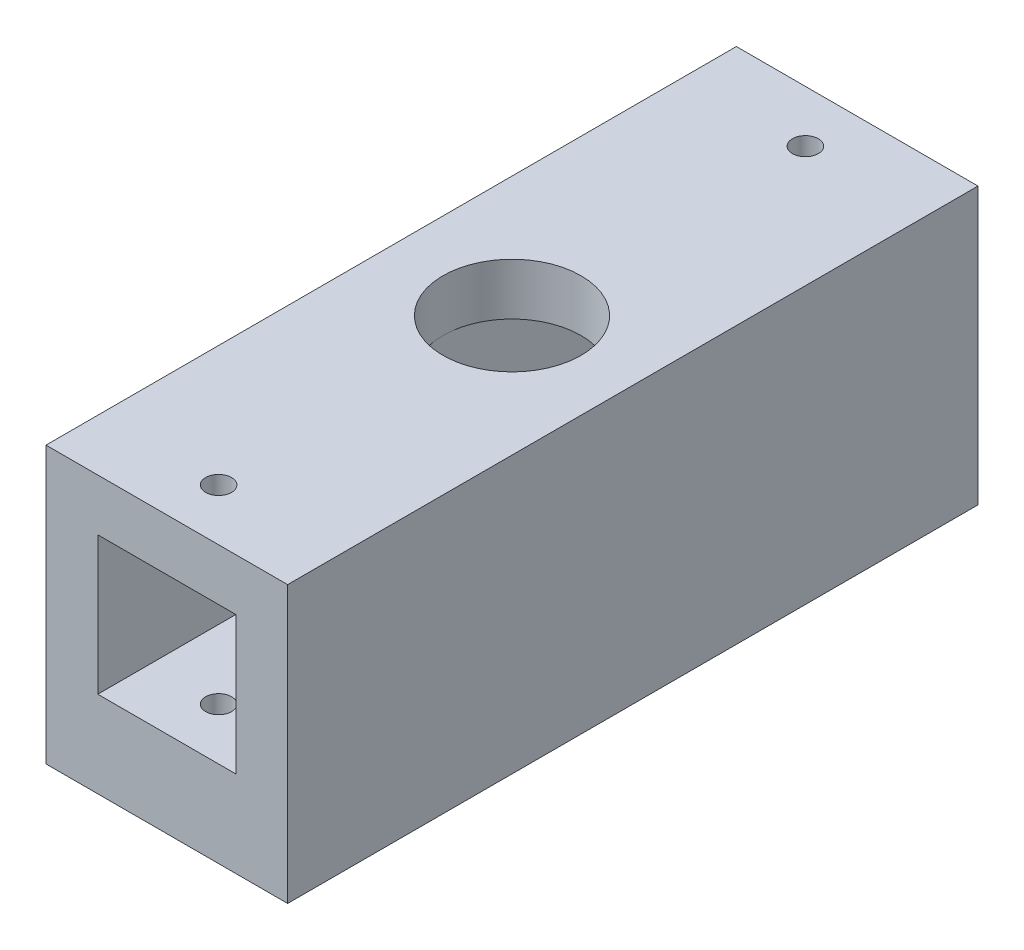
ISO-10303-21;
HEADER;
FILE_DESCRIPTION(('STEP AP214'),'2;1');
FILE_NAME('part.step','',(''),(''),'','','');
FILE_SCHEMA(('AUTOMOTIVE_DESIGN { 1 0 10303 214 1 1 1 1 }'));
ENDSEC;
DATA;
#1=APPLICATION_CONTEXT('core data for automotive mechanical design processes');
#2=APPLICATION_PROTOCOL_DEFINITION('international standard','automotive_design',2000,#1);
#3=PRODUCT_CONTEXT('',#1,'mechanical');
#4=PRODUCT('Part','Part','',(#3));
#5=PRODUCT_RELATED_PRODUCT_CATEGORY('part','',(#4));
#6=PRODUCT_DEFINITION_FORMATION('','',#4);
#7=PRODUCT_DEFINITION_CONTEXT('part definition',#1,'design');
#8=PRODUCT_DEFINITION('design','',#6,#7);
#9=PRODUCT_DEFINITION_SHAPE('','',#8);
#10=(LENGTH_UNIT() NAMED_UNIT(*) SI_UNIT(.MILLI.,.METRE.));
#11=(NAMED_UNIT(*) PLANE_ANGLE_UNIT() SI_UNIT($,.RADIAN.));
#12=(NAMED_UNIT(*) SI_UNIT($,.STERADIAN.) SOLID_ANGLE_UNIT());
#13=UNCERTAINTY_MEASURE_WITH_UNIT(LENGTH_MEASURE(1.E-05),#10,'distance_accuracy_value','');
#14=(GEOMETRIC_REPRESENTATION_CONTEXT(3) GLOBAL_UNCERTAINTY_ASSIGNED_CONTEXT((#13)) GLOBAL_UNIT_ASSIGNED_CONTEXT((#10,
#11,#12)) REPRESENTATION_CONTEXT('',''));
#15=CARTESIAN_POINT('',(0.,0.,0.));
#16=DIRECTION('',(0.,0.,1.));
#17=DIRECTION('',(1.,0.,0.));
#18=AXIS2_PLACEMENT_3D('',#15,#16,#17);
#19=CARTESIAN_POINT('',(-4.,4.,40.));
#20=DIRECTION('',(0.,-1.,0.));
#21=DIRECTION('',(0.,0.,-1.));
#22=AXIS2_PLACEMENT_3D('',#19,#20,#21);
#23=PLANE('',#22);
#24=CARTESIAN_POINT('',(0.,4.,37.));
#25=DIRECTION('',(0.,-1.,0.));
#26=DIRECTION('',(0.,0.,-1.));
#27=AXIS2_PLACEMENT_3D('',#24,#25,#26);
#28=CIRCLE('',#27,0.75);
#29=CARTESIAN_POINT('',(0.,4.,36.25));
#30=VERTEX_POINT('',#29);
#31=EDGE_CURVE('E182',#30,#30,#28,.T.);
#32=ORIENTED_EDGE('',*,*,#31,.F.);
#33=EDGE_LOOP('',(#32));
#34=FACE_BOUND('',#33,.T.);
#35=DIRECTION('',(0.,0.,-1.));
#36=VECTOR('',#35,1.);
#37=CARTESIAN_POINT('',(-4.,4.,40.));
#38=LINE('',#37,#36);
#39=CARTESIAN_POINT('',(-4.,4.,40.));
#40=VERTEX_POINT('',#39);
#41=CARTESIAN_POINT('',(-4.,4.,20.));
#42=VERTEX_POINT('',#41);
#43=EDGE_CURVE('E139',#40,#42,#38,.T.);
#44=ORIENTED_EDGE('',*,*,#43,.T.);
#45=CARTESIAN_POINT('',(0.,4.,20.));
#46=DIRECTION('',(0.,-1.,0.));
#47=DIRECTION('',(0.,0.,-1.));
#48=AXIS2_PLACEMENT_3D('',#45,#46,#47);
#49=CIRCLE('',#48,4.);
#50=CARTESIAN_POINT('',(4.,4.,20.));
#51=VERTEX_POINT('',#50);
#52=EDGE_CURVE('E47',#42,#51,#49,.F.);
#53=ORIENTED_EDGE('',*,*,#52,.T.);
#54=DIRECTION('',(0.,0.,-1.));
#55=VECTOR('',#54,1.);
#56=CARTESIAN_POINT('',(4.,4.,40.));
#57=LINE('',#56,#55);
#58=CARTESIAN_POINT('',(4.,4.,40.));
#59=VERTEX_POINT('',#58);
#60=EDGE_CURVE('E143',#59,#51,#57,.T.);
#61=ORIENTED_EDGE('',*,*,#60,.F.);
#62=DIRECTION('',(-1.,0.,0.));
#63=VECTOR('',#62,1.);
#64=CARTESIAN_POINT('',(-4.,4.,40.));
#65=LINE('',#64,#63);
#66=EDGE_CURVE('E218',#59,#40,#65,.T.);
#67=ORIENTED_EDGE('',*,*,#66,.T.);
#68=EDGE_LOOP('',(#44,#53,#61,#67));
#69=FACE_BOUND('',#68,.T.);
#70=ADVANCED_FACE('F33',(#34,#69),#23,.T.);
#71=CARTESIAN_POINT('',(-4.,-4.,40.));
#72=DIRECTION('',(0.,1.,0.));
#73=DIRECTION('',(0.,0.,1.));
#74=AXIS2_PLACEMENT_3D('',#71,#72,#73);
#75=PLANE('',#74);
#76=CARTESIAN_POINT('',(0.,-4.,3.));
#77=DIRECTION('',(0.,1.,0.));
#78=DIRECTION('',(0.,0.,1.));
#79=AXIS2_PLACEMENT_3D('',#76,#77,#78);
#80=CIRCLE('',#79,0.75);
#81=CARTESIAN_POINT('',(0.,-4.,3.75));
#82=VERTEX_POINT('',#81);
#83=EDGE_CURVE('E175',#82,#82,#80,.T.);
#84=ORIENTED_EDGE('',*,*,#83,.F.);
#85=EDGE_LOOP('',(#84));
#86=FACE_BOUND('',#85,.T.);
#87=DIRECTION('',(0.,0.,-1.));
#88=VECTOR('',#87,1.);
#89=CARTESIAN_POINT('',(-4.,-4.,40.));
#90=LINE('',#89,#88);
#91=CARTESIAN_POINT('',(-4.,-4.,20.));
#92=VERTEX_POINT('',#91);
#93=CARTESIAN_POINT('',(-4.,-4.,0.));
#94=VERTEX_POINT('',#93);
#95=EDGE_CURVE('E117',#92,#94,#90,.T.);
#96=ORIENTED_EDGE('',*,*,#95,.F.);
#97=CARTESIAN_POINT('',(0.,-4.,20.));
#98=DIRECTION('',(0.,1.,0.));
#99=DIRECTION('',(0.,0.,1.));
#100=AXIS2_PLACEMENT_3D('',#97,#98,#99);
#101=CIRCLE('',#100,4.);
#102=CARTESIAN_POINT('',(4.,-4.,20.));
#103=VERTEX_POINT('',#102);
#104=EDGE_CURVE('E11',#92,#103,#101,.F.);
#105=ORIENTED_EDGE('',*,*,#104,.T.);
#106=DIRECTION('',(0.,0.,-1.));
#107=VECTOR('',#106,1.);
#108=CARTESIAN_POINT('',(4.,-4.,40.));
#109=LINE('',#108,#107);
#110=CARTESIAN_POINT('',(4.,-4.,0.));
#111=VERTEX_POINT('',#110);
#112=EDGE_CURVE('E115',#103,#111,#109,.T.);
#113=ORIENTED_EDGE('',*,*,#112,.T.);
#114=DIRECTION('',(1.,0.,0.));
#115=VECTOR('',#114,1.);
#116=CARTESIAN_POINT('',(-4.,-4.,0.));
#117=LINE('',#116,#115);
#118=EDGE_CURVE('E135',#94,#111,#117,.T.);
#119=ORIENTED_EDGE('',*,*,#118,.F.);
#120=EDGE_LOOP('',(#96,#105,#113,#119));
#121=FACE_BOUND('',#120,.T.);
#122=ADVANCED_FACE('F113',(#86,#121),#75,.T.);
#123=CARTESIAN_POINT('',(0.,-22.,20.));
#124=DIRECTION('',(0.,1.,0.));
#125=DIRECTION('',(0.,0.,1.));
#126=AXIS2_PLACEMENT_3D('',#123,#124,#125);
#127=CYLINDRICAL_SURFACE('',#126,2.75);
#128=CARTESIAN_POINT('',(0.,-9.,20.));
#129=DIRECTION('',(0.,1.,0.));
#130=DIRECTION('',(0.,0.,1.));
#131=AXIS2_PLACEMENT_3D('',#128,#129,#130);
#132=CIRCLE('',#131,2.75);
#133=CARTESIAN_POINT('',(0.,-9.,22.75));
#134=VERTEX_POINT('',#133);
#135=EDGE_CURVE('E213',#134,#134,#132,.T.);
#136=ORIENTED_EDGE('',*,*,#135,.F.);
#137=EDGE_LOOP('',(#136));
#138=FACE_BOUND('',#137,.T.);
#139=CARTESIAN_POINT('',(0.,-6.,20.));
#140=DIRECTION('',(0.,1.,0.));
#141=DIRECTION('',(0.,0.,1.));
#142=AXIS2_PLACEMENT_3D('',#139,#140,#141);
#143=CIRCLE('',#142,2.75);
#144=CARTESIAN_POINT('',(0.,-6.,22.75));
#145=VERTEX_POINT('',#144);
#146=EDGE_CURVE('E184',#145,#145,#143,.F.);
#147=ORIENTED_EDGE('',*,*,#146,.F.);
#148=EDGE_LOOP('',(#147));
#149=FACE_BOUND('',#148,.T.);
#150=ADVANCED_FACE('F252',(#138,#149),#127,.F.);
#151=CARTESIAN_POINT('',(0.,0.,40.));
#152=DIRECTION('',(0.,0.,-1.));
#153=DIRECTION('',(-1.,0.,0.));
#154=AXIS2_PLACEMENT_3D('',#151,#152,#153);
#155=PLANE('',#154);
#156=DIRECTION('',(-1.,0.,0.));
#157=VECTOR('',#156,1.);
#158=CARTESIAN_POINT('',(-7.,7.,40.));
#159=LINE('',#158,#157);
#160=CARTESIAN_POINT('',(7.,7.,40.));
#161=VERTEX_POINT('',#160);
#162=CARTESIAN_POINT('',(-7.,7.,40.));
#163=VERTEX_POINT('',#162);
#164=EDGE_CURVE('E146',#161,#163,#159,.T.);
#165=ORIENTED_EDGE('',*,*,#164,.T.);
#166=DIRECTION('',(0.,-1.,0.));
#167=VECTOR('',#166,1.);
#168=CARTESIAN_POINT('',(-7.,7.,40.));
#169=LINE('',#168,#167);
#170=CARTESIAN_POINT('',(-7.,-9.,40.));
#171=VERTEX_POINT('',#170);
#172=EDGE_CURVE('E149',#163,#171,#169,.T.);
#173=ORIENTED_EDGE('',*,*,#172,.T.);
#174=DIRECTION('',(1.,0.,0.));
#175=VECTOR('',#174,1.);
#176=CARTESIAN_POINT('',(7.,-9.,40.));
#177=LINE('',#176,#175);
#178=CARTESIAN_POINT('',(7.,-9.,40.));
#179=VERTEX_POINT('',#178);
#180=EDGE_CURVE('E152',#171,#179,#177,.T.);
#181=ORIENTED_EDGE('',*,*,#180,.T.);
#182=DIRECTION('',(0.,1.,0.));
#183=VECTOR('',#182,1.);
#184=CARTESIAN_POINT('',(7.,-7.,40.));
#185=LINE('',#184,#183);
#186=EDGE_CURVE('E154',#179,#161,#185,.T.);
#187=ORIENTED_EDGE('',*,*,#186,.T.);
#188=EDGE_LOOP('',(#165,#173,#181,#187));
#189=FACE_BOUND('',#188,.T.);
#190=DIRECTION('',(0.,1.,0.));
#191=VECTOR('',#190,1.);
#192=CARTESIAN_POINT('',(4.,4.,40.));
#193=LINE('',#192,#191);
#194=CARTESIAN_POINT('',(4.,-4.,40.));
#195=VERTEX_POINT('',#194);
#196=EDGE_CURVE('E216',#195,#59,#193,.T.);
#197=ORIENTED_EDGE('',*,*,#196,.F.);
#198=DIRECTION('',(1.,0.,0.));
#199=VECTOR('',#198,1.);
#200=CARTESIAN_POINT('',(-4.,-4.,40.));
#201=LINE('',#200,#199);
#202=CARTESIAN_POINT('',(-4.,-4.,40.));
#203=VERTEX_POINT('',#202);
#204=EDGE_CURVE('E128',#203,#195,#201,.T.);
#205=ORIENTED_EDGE('',*,*,#204,.F.);
#206=DIRECTION('',(0.,-1.,0.));
#207=VECTOR('',#206,1.);
#208=CARTESIAN_POINT('',(-4.,4.,40.));
#209=LINE('',#208,#207);
#210=EDGE_CURVE('E220',#40,#203,#209,.T.);
#211=ORIENTED_EDGE('',*,*,#210,.F.);
#212=ORIENTED_EDGE('',*,*,#66,.F.);
#213=EDGE_LOOP('',(#197,#205,#211,#212));
#214=FACE_BOUND('',#213,.T.);
#215=ADVANCED_FACE('F243',(#189,#214),#155,.F.);
#216=CARTESIAN_POINT('',(0.,0.,0.));
#217=DIRECTION('',(0.,0.,-1.));
#218=DIRECTION('',(-1.,0.,0.));
#219=AXIS2_PLACEMENT_3D('',#216,#217,#218);
#220=PLANE('',#219);
#221=DIRECTION('',(-1.,0.,0.));
#222=VECTOR('',#221,1.);
#223=CARTESIAN_POINT('',(-7.,7.,0.));
#224=LINE('',#223,#222);
#225=CARTESIAN_POINT('',(7.,7.,0.));
#226=VERTEX_POINT('',#225);
#227=CARTESIAN_POINT('',(-7.,7.,0.));
#228=VERTEX_POINT('',#227);
#229=EDGE_CURVE('E145',#226,#228,#224,.T.);
#230=ORIENTED_EDGE('',*,*,#229,.F.);
#231=DIRECTION('',(0.,1.,0.));
#232=VECTOR('',#231,1.);
#233=CARTESIAN_POINT('',(7.,7.,0.));
#234=LINE('',#233,#232);
#235=CARTESIAN_POINT('',(7.,-9.,0.));
#236=VERTEX_POINT('',#235);
#237=EDGE_CURVE('E150',#236,#226,#234,.T.);
#238=ORIENTED_EDGE('',*,*,#237,.F.);
#239=DIRECTION('',(1.,0.,0.));
#240=VECTOR('',#239,1.);
#241=CARTESIAN_POINT('',(7.,-9.,0.));
#242=LINE('',#241,#240);
#243=CARTESIAN_POINT('',(-7.,-9.,0.));
#244=VERTEX_POINT('',#243);
#245=EDGE_CURVE('E161',#244,#236,#242,.T.);
#246=ORIENTED_EDGE('',*,*,#245,.F.);
#247=DIRECTION('',(0.,-1.,0.));
#248=VECTOR('',#247,1.);
#249=CARTESIAN_POINT('',(-7.,-9.,0.));
#250=LINE('',#249,#248);
#251=EDGE_CURVE('E159',#228,#244,#250,.T.);
#252=ORIENTED_EDGE('',*,*,#251,.F.);
#253=EDGE_LOOP('',(#230,#238,#246,#252));
#254=FACE_BOUND('',#253,.T.);
#255=ORIENTED_EDGE('',*,*,#118,.T.);
#256=DIRECTION('',(0.,1.,0.));
#257=VECTOR('',#256,1.);
#258=CARTESIAN_POINT('',(4.,4.,0.));
#259=LINE('',#258,#257);
#260=CARTESIAN_POINT('',(4.,4.,0.));
#261=VERTEX_POINT('',#260);
#262=EDGE_CURVE('E126',#111,#261,#259,.T.);
#263=ORIENTED_EDGE('',*,*,#262,.T.);
#264=DIRECTION('',(-1.,0.,0.));
#265=VECTOR('',#264,1.);
#266=CARTESIAN_POINT('',(-4.,4.,0.));
#267=LINE('',#266,#265);
#268=CARTESIAN_POINT('',(-4.,4.,0.));
#269=VERTEX_POINT('',#268);
#270=EDGE_CURVE('E225',#261,#269,#267,.T.);
#271=ORIENTED_EDGE('',*,*,#270,.T.);
#272=DIRECTION('',(0.,-1.,0.));
#273=VECTOR('',#272,1.);
#274=CARTESIAN_POINT('',(-4.,4.,0.));
#275=LINE('',#274,#273);
#276=EDGE_CURVE('E227',#269,#94,#275,.T.);
#277=ORIENTED_EDGE('',*,*,#276,.T.);
#278=EDGE_LOOP('',(#255,#263,#271,#277));
#279=FACE_BOUND('',#278,.T.);
#280=ADVANCED_FACE('F231',(#254,#279),#220,.T.);
#281=CARTESIAN_POINT('',(-7.,7.,40.));
#282=DIRECTION('',(0.,-1.,0.));
#283=DIRECTION('',(0.,0.,-1.));
#284=AXIS2_PLACEMENT_3D('',#281,#282,#283);
#285=PLANE('',#284);
#286=CARTESIAN_POINT('',(0.,7.,20.));
#287=DIRECTION('',(0.,-1.,0.));
#288=DIRECTION('',(0.,0.,-1.));
#289=AXIS2_PLACEMENT_3D('',#286,#287,#288);
#290=CIRCLE('',#289,4.);
#291=CARTESIAN_POINT('',(0.,7.,16.));
#292=VERTEX_POINT('',#291);
#293=EDGE_CURVE('E196',#292,#292,#290,.F.);
#294=ORIENTED_EDGE('',*,*,#293,.F.);
#295=EDGE_LOOP('',(#294));
#296=FACE_BOUND('',#295,.T.);
#297=CARTESIAN_POINT('',(0.,7.,37.));
#298=DIRECTION('',(0.,1.,0.));
#299=DIRECTION('',(0.,0.,1.));
#300=AXIS2_PLACEMENT_3D('',#297,#298,#299);
#301=CIRCLE('',#300,0.75);
#302=CARTESIAN_POINT('',(0.,7.,37.75));
#303=VERTEX_POINT('',#302);
#304=EDGE_CURVE('E183',#303,#303,#301,.T.);
#305=ORIENTED_EDGE('',*,*,#304,.F.);
#306=EDGE_LOOP('',(#305));
#307=FACE_BOUND('',#306,.T.);
#308=CARTESIAN_POINT('',(0.,7.,3.));
#309=DIRECTION('',(0.,1.,0.));
#310=DIRECTION('',(0.,0.,1.));
#311=AXIS2_PLACEMENT_3D('',#308,#309,#310);
#312=CIRCLE('',#311,0.75);
#313=CARTESIAN_POINT('',(0.,7.,3.75));
#314=VERTEX_POINT('',#313);
#315=EDGE_CURVE('E179',#314,#314,#312,.T.);
#316=ORIENTED_EDGE('',*,*,#315,.F.);
#317=EDGE_LOOP('',(#316));
#318=FACE_BOUND('',#317,.T.);
#319=ORIENTED_EDGE('',*,*,#229,.T.);
#320=DIRECTION('',(0.,0.,-1.));
#321=VECTOR('',#320,1.);
#322=CARTESIAN_POINT('',(-7.,7.,40.));
#323=LINE('',#322,#321);
#324=EDGE_CURVE('E110',#163,#228,#323,.T.);
#325=ORIENTED_EDGE('',*,*,#324,.F.);
#326=ORIENTED_EDGE('',*,*,#164,.F.);
#327=DIRECTION('',(0.,0.,-1.));
#328=VECTOR('',#327,1.);
#329=CARTESIAN_POINT('',(7.,7.,40.));
#330=LINE('',#329,#328);
#331=EDGE_CURVE('E156',#161,#226,#330,.T.);
#332=ORIENTED_EDGE('',*,*,#331,.T.);
#333=EDGE_LOOP('',(#319,#325,#326,#332));
#334=FACE_BOUND('',#333,.T.);
#335=ADVANCED_FACE('F35',(#296,#307,#318,#334),#285,.F.);
#336=CARTESIAN_POINT('',(-7.,-9.,40.));
#337=DIRECTION('',(1.,0.,0.));
#338=DIRECTION('',(0.,0.,-1.));
#339=AXIS2_PLACEMENT_3D('',#336,#337,#338);
#340=PLANE('',#339);
#341=ORIENTED_EDGE('',*,*,#251,.T.);
#342=DIRECTION('',(0.,0.,-1.));
#343=VECTOR('',#342,1.);
#344=CARTESIAN_POINT('',(-7.,-9.,40.));
#345=LINE('',#344,#343);
#346=EDGE_CURVE('E170',#171,#244,#345,.T.);
#347=ORIENTED_EDGE('',*,*,#346,.F.);
#348=ORIENTED_EDGE('',*,*,#172,.F.);
#349=ORIENTED_EDGE('',*,*,#324,.T.);
#350=EDGE_LOOP('',(#341,#347,#348,#349));
#351=FACE_BOUND('',#350,.T.);
#352=ADVANCED_FACE('F277',(#351),#340,.F.);
#353=CARTESIAN_POINT('',(7.,-9.,40.));
#354=DIRECTION('',(0.,1.,0.));
#355=DIRECTION('',(0.,0.,1.));
#356=AXIS2_PLACEMENT_3D('',#353,#354,#355);
#357=PLANE('',#356);
#358=CARTESIAN_POINT('',(0.,-9.,37.));
#359=DIRECTION('',(0.,1.,0.));
#360=DIRECTION('',(0.,0.,1.));
#361=AXIS2_PLACEMENT_3D('',#358,#359,#360);
#362=CIRCLE('',#361,0.75);
#363=CARTESIAN_POINT('',(0.,-9.,37.75));
#364=VERTEX_POINT('',#363);
#365=EDGE_CURVE('E203',#364,#364,#362,.T.);
#366=ORIENTED_EDGE('',*,*,#365,.T.);
#367=EDGE_LOOP('',(#366));
#368=FACE_BOUND('',#367,.T.);
#369=CARTESIAN_POINT('',(0.,-9.,3.));
#370=DIRECTION('',(0.,1.,0.));
#371=DIRECTION('',(0.,0.,1.));
#372=AXIS2_PLACEMENT_3D('',#369,#370,#371);
#373=CIRCLE('',#372,0.75);
#374=CARTESIAN_POINT('',(0.,-9.,3.75));
#375=VERTEX_POINT('',#374);
#376=EDGE_CURVE('E210',#375,#375,#373,.T.);
#377=ORIENTED_EDGE('',*,*,#376,.T.);
#378=EDGE_LOOP('',(#377));
#379=FACE_BOUND('',#378,.T.);
#380=ORIENTED_EDGE('',*,*,#135,.T.);
#381=EDGE_LOOP('',(#380));
#382=FACE_BOUND('',#381,.T.);
#383=ORIENTED_EDGE('',*,*,#245,.T.);
#384=DIRECTION('',(0.,0.,-1.));
#385=VECTOR('',#384,1.);
#386=CARTESIAN_POINT('',(7.,-9.,40.));
#387=LINE('',#386,#385);
#388=EDGE_CURVE('E167',#179,#236,#387,.T.);
#389=ORIENTED_EDGE('',*,*,#388,.F.);
#390=ORIENTED_EDGE('',*,*,#180,.F.);
#391=ORIENTED_EDGE('',*,*,#346,.T.);
#392=EDGE_LOOP('',(#383,#389,#390,#391));
#393=FACE_BOUND('',#392,.T.);
#394=ADVANCED_FACE('F293',(#368,#379,#382,#393),#357,.F.);
#395=CARTESIAN_POINT('',(7.,7.,40.));
#396=DIRECTION('',(-1.,0.,0.));
#397=DIRECTION('',(0.,-1.,0.));
#398=AXIS2_PLACEMENT_3D('',#395,#396,#397);
#399=PLANE('',#398);
#400=ORIENTED_EDGE('',*,*,#237,.T.);
#401=ORIENTED_EDGE('',*,*,#331,.F.);
#402=ORIENTED_EDGE('',*,*,#186,.F.);
#403=ORIENTED_EDGE('',*,*,#388,.T.);
#404=EDGE_LOOP('',(#400,#401,#402,#403));
#405=FACE_BOUND('',#404,.T.);
#406=ADVANCED_FACE('F264',(#405),#399,.F.);
#407=CARTESIAN_POINT('',(4.,4.,40.));
#408=DIRECTION('',(-1.,0.,0.));
#409=DIRECTION('',(0.,-1.,0.));
#410=AXIS2_PLACEMENT_3D('',#407,#408,#409);
#411=PLANE('',#410);
#412=ORIENTED_EDGE('',*,*,#60,.T.);
#413=EDGE_CURVE('E142',#51,#261,#57,.T.);
#414=ORIENTED_EDGE('',*,*,#413,.T.);
#415=ORIENTED_EDGE('',*,*,#262,.F.);
#416=ORIENTED_EDGE('',*,*,#112,.F.);
#417=EDGE_CURVE('E123',#195,#103,#109,.T.);
#418=ORIENTED_EDGE('',*,*,#417,.F.);
#419=ORIENTED_EDGE('',*,*,#196,.T.);
#420=EDGE_LOOP('',(#412,#414,#415,#416,#418,#419));
#421=FACE_BOUND('',#420,.T.);
#422=ADVANCED_FACE('F122',(#421),#411,.T.);
#423=CARTESIAN_POINT('',(0.,4.,3.));
#424=DIRECTION('',(0.,-1.,0.));
#425=DIRECTION('',(0.,0.,-1.));
#426=AXIS2_PLACEMENT_3D('',#423,#424,#425);
#427=CIRCLE('',#426,0.75);
#428=CARTESIAN_POINT('',(0.,4.,2.25));
#429=VERTEX_POINT('',#428);
#430=EDGE_CURVE('E178',#429,#429,#427,.T.);
#431=ORIENTED_EDGE('',*,*,#430,.F.);
#432=EDGE_LOOP('',(#431));
#433=FACE_BOUND('',#432,.T.);
#434=ORIENTED_EDGE('',*,*,#413,.F.);
#435=EDGE_CURVE('E186',#51,#42,#49,.F.);
#436=ORIENTED_EDGE('',*,*,#435,.T.);
#437=EDGE_CURVE('E138',#42,#269,#38,.T.);
#438=ORIENTED_EDGE('',*,*,#437,.T.);
#439=ORIENTED_EDGE('',*,*,#270,.F.);
#440=EDGE_LOOP('',(#434,#436,#438,#439));
#441=FACE_BOUND('',#440,.T.);
#442=ADVANCED_FACE('F235',(#433,#441),#23,.T.);
#443=CARTESIAN_POINT('',(-4.,4.,40.));
#444=DIRECTION('',(1.,0.,0.));
#445=DIRECTION('',(0.,1.,0.));
#446=AXIS2_PLACEMENT_3D('',#443,#444,#445);
#447=PLANE('',#446);
#448=ORIENTED_EDGE('',*,*,#437,.F.);
#449=ORIENTED_EDGE('',*,*,#43,.F.);
#450=ORIENTED_EDGE('',*,*,#210,.T.);
#451=EDGE_CURVE('E132',#203,#92,#90,.T.);
#452=ORIENTED_EDGE('',*,*,#451,.T.);
#453=ORIENTED_EDGE('',*,*,#95,.T.);
#454=ORIENTED_EDGE('',*,*,#276,.F.);
#455=EDGE_LOOP('',(#448,#449,#450,#452,#453,#454));
#456=FACE_BOUND('',#455,.T.);
#457=ADVANCED_FACE('F239',(#456),#447,.T.);
#458=CARTESIAN_POINT('',(0.,-4.,37.));
#459=DIRECTION('',(0.,1.,0.));
#460=DIRECTION('',(0.,0.,1.));
#461=AXIS2_PLACEMENT_3D('',#458,#459,#460);
#462=CIRCLE('',#461,0.75);
#463=CARTESIAN_POINT('',(0.,-4.,37.75));
#464=VERTEX_POINT('',#463);
#465=EDGE_CURVE('E180',#464,#464,#462,.T.);
#466=ORIENTED_EDGE('',*,*,#465,.F.);
#467=EDGE_LOOP('',(#466));
#468=FACE_BOUND('',#467,.T.);
#469=ORIENTED_EDGE('',*,*,#417,.T.);
#470=EDGE_CURVE('E37',#103,#92,#101,.F.);
#471=ORIENTED_EDGE('',*,*,#470,.T.);
#472=ORIENTED_EDGE('',*,*,#451,.F.);
#473=ORIENTED_EDGE('',*,*,#204,.T.);
#474=EDGE_LOOP('',(#469,#471,#472,#473));
#475=FACE_BOUND('',#474,.T.);
#476=ADVANCED_FACE('F130',(#468,#475),#75,.T.);
#477=CARTESIAN_POINT('',(0.,-12.,3.));
#478=DIRECTION('',(0.,1.,0.));
#479=DIRECTION('',(0.,0.,1.));
#480=AXIS2_PLACEMENT_3D('',#477,#478,#479);
#481=CYLINDRICAL_SURFACE('',#480,0.75);
#482=ORIENTED_EDGE('',*,*,#83,.T.);
#483=EDGE_LOOP('',(#482));
#484=FACE_BOUND('',#483,.T.);
#485=ORIENTED_EDGE('',*,*,#376,.F.);
#486=EDGE_LOOP('',(#485));
#487=FACE_BOUND('',#486,.T.);
#488=ADVANCED_FACE('F271',(#484,#487),#481,.F.);
#489=ORIENTED_EDGE('',*,*,#430,.T.);
#490=EDGE_LOOP('',(#489));
#491=FACE_BOUND('',#490,.T.);
#492=ORIENTED_EDGE('',*,*,#315,.T.);
#493=EDGE_LOOP('',(#492));
#494=FACE_BOUND('',#493,.T.);
#495=ADVANCED_FACE('F267',(#491,#494),#481,.F.);
#496=CARTESIAN_POINT('',(0.,-12.,37.));
#497=DIRECTION('',(0.,1.,0.));
#498=DIRECTION('',(0.,0.,1.));
#499=AXIS2_PLACEMENT_3D('',#496,#497,#498);
#500=CYLINDRICAL_SURFACE('',#499,0.75);
#501=ORIENTED_EDGE('',*,*,#465,.T.);
#502=EDGE_LOOP('',(#501));
#503=FACE_BOUND('',#502,.T.);
#504=ORIENTED_EDGE('',*,*,#365,.F.);
#505=EDGE_LOOP('',(#504));
#506=FACE_BOUND('',#505,.T.);
#507=ADVANCED_FACE('F270',(#503,#506),#500,.F.);
#508=ORIENTED_EDGE('',*,*,#31,.T.);
#509=EDGE_LOOP('',(#508));
#510=FACE_BOUND('',#509,.T.);
#511=ORIENTED_EDGE('',*,*,#304,.T.);
#512=EDGE_LOOP('',(#511));
#513=FACE_BOUND('',#512,.T.);
#514=ADVANCED_FACE('F327',(#510,#513),#500,.F.);
#515=CARTESIAN_POINT('',(0.,-6.,20.));
#516=DIRECTION('',(0.,1.,0.));
#517=DIRECTION('',(0.,0.,1.));
#518=AXIS2_PLACEMENT_3D('',#515,#516,#517);
#519=PLANE('',#518);
#520=CARTESIAN_POINT('',(0.,-6.,20.));
#521=DIRECTION('',(0.,1.,0.));
#522=DIRECTION('',(0.,0.,1.));
#523=AXIS2_PLACEMENT_3D('',#520,#521,#522);
#524=CIRCLE('',#523,4.);
#525=CARTESIAN_POINT('',(0.,-6.,24.));
#526=VERTEX_POINT('',#525);
#527=EDGE_CURVE('E187',#526,#526,#524,.T.);
#528=ORIENTED_EDGE('',*,*,#527,.T.);
#529=EDGE_LOOP('',(#528));
#530=FACE_BOUND('',#529,.T.);
#531=ORIENTED_EDGE('',*,*,#146,.T.);
#532=EDGE_LOOP('',(#531));
#533=FACE_BOUND('',#532,.T.);
#534=ADVANCED_FACE('F332',(#530,#533),#519,.T.);
#535=CARTESIAN_POINT('',(0.,26.,20.));
#536=DIRECTION('',(0.,-1.,0.));
#537=DIRECTION('',(0.,0.,-1.));
#538=AXIS2_PLACEMENT_3D('',#535,#536,#537);
#539=CYLINDRICAL_SURFACE('',#538,4.);
#540=ORIENTED_EDGE('',*,*,#470,.F.);
#541=ORIENTED_EDGE('',*,*,#104,.F.);
#542=EDGE_LOOP('',(#540,#541));
#543=FACE_BOUND('',#542,.T.);
#544=ORIENTED_EDGE('',*,*,#527,.F.);
#545=EDGE_LOOP('',(#544));
#546=FACE_BOUND('',#545,.T.);
#547=ADVANCED_FACE('F105',(#543,#546),#539,.F.);
#548=ORIENTED_EDGE('',*,*,#435,.F.);
#549=ORIENTED_EDGE('',*,*,#52,.F.);
#550=EDGE_LOOP('',(#548,#549));
#551=FACE_BOUND('',#550,.T.);
#552=ORIENTED_EDGE('',*,*,#293,.T.);
#553=EDGE_LOOP('',(#552));
#554=FACE_BOUND('',#553,.T.);
#555=ADVANCED_FACE('F337',(#551,#554),#539,.F.);
#556=CLOSED_SHELL('',(#70,#122,#150,#215,#280,#335,#352,#394,#406,#422,#442,#457,#476,#488,#495,
#507,#514,#534,#547,#555));
#557=MANIFOLD_SOLID_BREP('B2',#556);
#558=ADVANCED_BREP_SHAPE_REPRESENTATION('',(#18,#557),#14);
#559=SHAPE_DEFINITION_REPRESENTATION(#9,#558);
ENDSEC;
END-ISO-10303-21;
